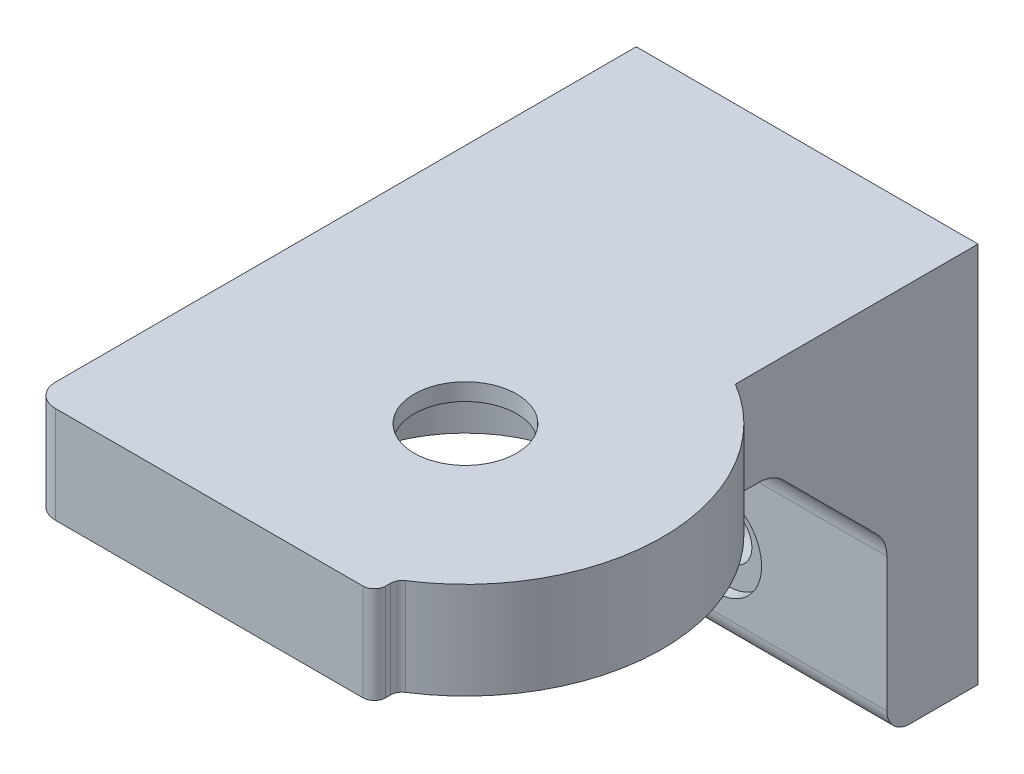
ISO-10303-21;
HEADER;
FILE_DESCRIPTION(('STEP AP214'),'2;1');
FILE_NAME('part.step','',(''),(''),'','','');
FILE_SCHEMA(('AUTOMOTIVE_DESIGN { 1 0 10303 214 1 1 1 1 }'));
ENDSEC;
DATA;
#1=APPLICATION_CONTEXT('core data for automotive mechanical design processes');
#2=APPLICATION_PROTOCOL_DEFINITION('international standard','automotive_design',2000,#1);
#3=PRODUCT_CONTEXT('',#1,'mechanical');
#4=PRODUCT('Part','Part','',(#3));
#5=PRODUCT_RELATED_PRODUCT_CATEGORY('part','',(#4));
#6=PRODUCT_DEFINITION_FORMATION('','',#4);
#7=PRODUCT_DEFINITION_CONTEXT('part definition',#1,'design');
#8=PRODUCT_DEFINITION('design','',#6,#7);
#9=PRODUCT_DEFINITION_SHAPE('','',#8);
#10=(LENGTH_UNIT() NAMED_UNIT(*) SI_UNIT(.MILLI.,.METRE.));
#11=(NAMED_UNIT(*) PLANE_ANGLE_UNIT() SI_UNIT($,.RADIAN.));
#12=(NAMED_UNIT(*) SI_UNIT($,.STERADIAN.) SOLID_ANGLE_UNIT());
#13=UNCERTAINTY_MEASURE_WITH_UNIT(LENGTH_MEASURE(1.E-05),#10,'distance_accuracy_value','');
#14=(GEOMETRIC_REPRESENTATION_CONTEXT(3) GLOBAL_UNCERTAINTY_ASSIGNED_CONTEXT((#13)) GLOBAL_UNIT_ASSIGNED_CONTEXT((#10,
#11,#12)) REPRESENTATION_CONTEXT('',''));
#15=CARTESIAN_POINT('',(0.,0.,0.));
#16=DIRECTION('',(0.,0.,1.));
#17=DIRECTION('',(1.,0.,0.));
#18=AXIS2_PLACEMENT_3D('',#15,#16,#17);
#19=CARTESIAN_POINT('',(4.69999956412333,-651.000000000001,1.34850202283498E-13));
#20=DIRECTION('',(0.,0.,1.));
#21=DIRECTION('',(-1.,0.,0.));
#22=AXIS2_PLACEMENT_3D('',#19,#20,#21);
#23=CYLINDRICAL_SURFACE('',#22,2.15);
#24=CARTESIAN_POINT('',(4.69999956412333,-651.000000000001,1.34850202283498E-13));
#25=DIRECTION('',(0.,0.,-1.));
#26=DIRECTION('',(-1.,0.,0.));
#27=AXIS2_PLACEMENT_3D('',#24,#25,#26);
#28=CIRCLE('',#27,2.15);
#29=CARTESIAN_POINT('',(2.54999956412332,-651.000000000001,1.354131691474E-13));
#30=VERTEX_POINT('',#29);
#31=EDGE_CURVE('E167',#30,#30,#28,.T.);
#32=ORIENTED_EDGE('',*,*,#31,.T.);
#33=EDGE_LOOP('',(#32));
#34=FACE_BOUND('',#33,.T.);
#35=CARTESIAN_POINT('',(4.69999956412555,-651.000000000001,6.99999999999998));
#36=DIRECTION('',(0.,0.,-1.));
#37=DIRECTION('',(-1.,0.,0.));
#38=AXIS2_PLACEMENT_3D('',#35,#36,#37);
#39=CIRCLE('',#38,2.15);
#40=CARTESIAN_POINT('',(2.54999956412555,-651.000000000001,6.99999999999998));
#41=VERTEX_POINT('',#40);
#42=EDGE_CURVE('E511',#41,#41,#39,.T.);
#43=ORIENTED_EDGE('',*,*,#42,.F.);
#44=EDGE_LOOP('',(#43));
#45=FACE_BOUND('',#44,.T.);
#46=ADVANCED_FACE('F35',(#34,#45),#23,.F.);
#47=CARTESIAN_POINT('',(-20.6000008716219,-626.500000000001,0.));
#48=DIRECTION('',(0.,1.,0.));
#49=DIRECTION('',(1.,0.,0.));
#50=AXIS2_PLACEMENT_3D('',#47,#48,#49);
#51=PLANE('',#50);
#52=CARTESIAN_POINT('',(10.8499995641886,-626.500000000001,36.149999999999));
#53=DIRECTION('',(0.,-1.,0.));
#54=DIRECTION('',(1.,0.,0.));
#55=AXIS2_PLACEMENT_3D('',#52,#53,#54);
#56=CIRCLE('',#55,4.5);
#57=CARTESIAN_POINT('',(15.3499995641886,-626.500000000001,36.149999999999));
#58=VERTEX_POINT('',#57);
#59=EDGE_CURVE('E161',#58,#58,#56,.T.);
#60=ORIENTED_EDGE('',*,*,#59,.F.);
#61=EDGE_LOOP('',(#60));
#62=FACE_BOUND('',#61,.T.);
#63=CARTESIAN_POINT('',(10.8499995641903,-626.500000000001,36.1500000000001));
#64=DIRECTION('',(0.,-1.,0.));
#65=DIRECTION('',(1.,0.,0.));
#66=AXIS2_PLACEMENT_3D('',#63,#64,#65);
#67=CIRCLE('',#66,11.);
#68=CARTESIAN_POINT('',(21.8499995641903,-626.500000000001,36.1500000000001));
#69=VERTEX_POINT('',#68);
#70=EDGE_CURVE('E215',#69,#69,#67,.T.);
#71=ORIENTED_EDGE('',*,*,#70,.T.);
#72=EDGE_LOOP('',(#71));
#73=FACE_BOUND('',#72,.T.);
#74=ADVANCED_FACE('F336',(#62,#73),#51,.F.);
#75=CARTESIAN_POINT('',(10.8499995641898,-626.500000000001,36.149999999999));
#76=DIRECTION('',(0.,1.,0.));
#77=DIRECTION('',(1.,0.,0.));
#78=AXIS2_PLACEMENT_3D('',#75,#76,#77);
#79=CYLINDRICAL_SURFACE('',#78,17.2871339440318);
#80=CARTESIAN_POINT('',(10.8499995641898,-633.500000000001,36.149999999999));
#81=DIRECTION('',(0.,-1.,0.));
#82=DIRECTION('',(1.,0.,0.));
#83=AXIS2_PLACEMENT_3D('',#80,#81,#82);
#84=CIRCLE('',#83,17.2871339440318);
#85=CARTESIAN_POINT('',(19.6999995641258,-633.500000000001,21.2999999999979));
#86=VERTEX_POINT('',#85);
#87=CARTESIAN_POINT('',(20.1613695070549,-633.500000000001,50.715142971697));
#88=VERTEX_POINT('',#87);
#89=EDGE_CURVE('E179',#86,#88,#84,.T.);
#90=ORIENTED_EDGE('',*,*,#89,.F.);
#91=DIRECTION('',(0.,1.,0.));
#92=VECTOR('',#91,1.);
#93=CARTESIAN_POINT('',(19.6999995641257,-626.500000000001,21.2999999999979));
#94=LINE('',#93,#92);
#95=CARTESIAN_POINT('',(19.6999995641257,-625.000000000001,21.2999999999979));
#96=VERTEX_POINT('',#95);
#97=EDGE_CURVE('E212',#86,#96,#94,.T.);
#98=ORIENTED_EDGE('',*,*,#97,.T.);
#99=CARTESIAN_POINT('',(10.8499995641898,-625.000000000001,36.149999999999));
#100=DIRECTION('',(0.,-1.,0.));
#101=DIRECTION('',(1.,0.,0.));
#102=AXIS2_PLACEMENT_3D('',#99,#100,#101);
#103=CIRCLE('',#102,17.2871339440318);
#104=CARTESIAN_POINT('',(20.1613695070548,-625.000000000001,50.715142971697));
#105=VERTEX_POINT('',#104);
#106=EDGE_CURVE('E193',#105,#96,#103,.F.);
#107=ORIENTED_EDGE('',*,*,#106,.F.);
#108=DIRECTION('',(0.,1.,0.));
#109=VECTOR('',#108,1.);
#110=CARTESIAN_POINT('',(20.1613695070548,-626.500000000001,50.715142971697));
#111=LINE('',#110,#109);
#112=EDGE_CURVE('E225',#88,#105,#111,.T.);
#113=ORIENTED_EDGE('',*,*,#112,.F.);
#114=EDGE_LOOP('',(#90,#98,#107,#113));
#115=FACE_BOUND('',#114,.T.);
#116=ADVANCED_FACE('F312',(#115),#79,.T.);
#117=CARTESIAN_POINT('',(19.6999995641257,-626.500000000001,0.));
#118=DIRECTION('',(1.,0.,0.));
#119=DIRECTION('',(0.,-1.,0.));
#120=AXIS2_PLACEMENT_3D('',#117,#118,#119);
#121=PLANE('',#120);
#122=DIRECTION('',(0.,0.,-1.));
#123=VECTOR('',#122,1.);
#124=CARTESIAN_POINT('',(19.6999995641258,-658.500000000001,8.00000000000058));
#125=LINE('',#124,#123);
#126=CARTESIAN_POINT('',(19.6999995641258,-658.500000000001,6.00000000000058));
#127=VERTEX_POINT('',#126);
#128=CARTESIAN_POINT('',(19.6999995641259,-658.500000000001,5.79383245849191E-13));
#129=VERTEX_POINT('',#128);
#130=EDGE_CURVE('E148',#127,#129,#125,.T.);
#131=ORIENTED_EDGE('',*,*,#130,.T.);
#132=DIRECTION('',(0.,1.,0.));
#133=VECTOR('',#132,1.);
#134=CARTESIAN_POINT('',(19.6999995641257,-626.500000000001,5.75011736338895E-13));
#135=LINE('',#134,#133);
#136=CARTESIAN_POINT('',(19.6999995641257,-625.000000000001,5.75011736338895E-13));
#137=VERTEX_POINT('',#136);
#138=EDGE_CURVE('E160',#129,#137,#135,.T.);
#139=ORIENTED_EDGE('',*,*,#138,.T.);
#140=DIRECTION('',(0.,0.,1.));
#141=VECTOR('',#140,1.);
#142=CARTESIAN_POINT('',(19.6999995641257,-625.000000000001,0.));
#143=LINE('',#142,#141);
#144=EDGE_CURVE('E208',#137,#96,#143,.T.);
#145=ORIENTED_EDGE('',*,*,#144,.T.);
#146=ORIENTED_EDGE('',*,*,#97,.F.);
#147=DIRECTION('',(0.,0.,1.));
#148=VECTOR('',#147,1.);
#149=CARTESIAN_POINT('',(19.6999995641257,-633.500000000001,0.));
#150=LINE('',#149,#148);
#151=CARTESIAN_POINT('',(19.6999995641258,-633.500000000001,19.2426406871199));
#152=VERTEX_POINT('',#151);
#153=EDGE_CURVE('E191',#152,#86,#150,.T.);
#154=ORIENTED_EDGE('',*,*,#153,.F.);
#155=CARTESIAN_POINT('',(19.6999995641258,-636.500000000001,19.2426406871199));
#156=DIRECTION('',(-1.,0.,0.));
#157=DIRECTION('',(0.,-1.,0.));
#158=AXIS2_PLACEMENT_3D('',#155,#156,#157);
#159=CIRCLE('',#158,3.);
#160=CARTESIAN_POINT('',(19.6999995641258,-634.378679656441,17.1213203435603));
#161=VERTEX_POINT('',#160);
#162=EDGE_CURVE('E272',#161,#152,#159,.F.);
#163=ORIENTED_EDGE('',*,*,#162,.F.);
#164=DIRECTION('',(0.,0.707106781186545,0.70710678118655));
#165=VECTOR('',#164,1.);
#166=CARTESIAN_POINT('',(19.6999995641258,-633.500000000001,18.0000000000006));
#167=LINE('',#166,#165);
#168=CARTESIAN_POINT('',(19.6999995641258,-642.621320343561,8.87867965644103));
#169=VERTEX_POINT('',#168);
#170=EDGE_CURVE('E222',#169,#161,#167,.T.);
#171=ORIENTED_EDGE('',*,*,#170,.F.);
#172=CARTESIAN_POINT('',(19.6999995641258,-644.74264068712,11.0000000000006));
#173=DIRECTION('',(-1.,0.,0.));
#174=DIRECTION('',(0.,-1.,0.));
#175=AXIS2_PLACEMENT_3D('',#172,#173,#174);
#176=CIRCLE('',#175,3.);
#177=CARTESIAN_POINT('',(19.6999995641257,-644.74264068712,8.00000000000058));
#178=VERTEX_POINT('',#177);
#179=EDGE_CURVE('E263',#178,#169,#176,.F.);
#180=ORIENTED_EDGE('',*,*,#179,.F.);
#181=DIRECTION('',(0.,1.,0.));
#182=VECTOR('',#181,1.);
#183=CARTESIAN_POINT('',(19.6999995641256,-633.500000000001,8.00000000000058));
#184=LINE('',#183,#182);
#185=CARTESIAN_POINT('',(19.6999995641258,-656.500000000001,8.00000000000058));
#186=VERTEX_POINT('',#185);
#187=EDGE_CURVE('E166',#186,#178,#184,.T.);
#188=ORIENTED_EDGE('',*,*,#187,.F.);
#189=CARTESIAN_POINT('',(19.6999995641258,-656.500000000001,6.00000000000058));
#190=DIRECTION('',(-1.,0.,0.));
#191=DIRECTION('',(0.,-1.,0.));
#192=AXIS2_PLACEMENT_3D('',#189,#190,#191);
#193=CIRCLE('',#192,2.);
#194=EDGE_CURVE('E276',#127,#186,#193,.T.);
#195=ORIENTED_EDGE('',*,*,#194,.F.);
#196=EDGE_LOOP('',(#131,#139,#145,#146,#154,#163,#171,#180,#188,#195));
#197=FACE_BOUND('',#196,.T.);
#198=ADVANCED_FACE('F281',(#197),#121,.T.);
#199=CARTESIAN_POINT('',(-20.6000008716219,-626.500000000001,0.));
#200=DIRECTION('',(0.,0.,1.));
#201=DIRECTION('',(-1.,0.,0.));
#202=AXIS2_PLACEMENT_3D('',#199,#200,#201);
#203=PLANE('',#202);
#204=ORIENTED_EDGE('',*,*,#31,.F.);
#205=EDGE_LOOP('',(#204));
#206=FACE_BOUND('',#205,.T.);
#207=DIRECTION('',(-1.,0.,0.));
#208=VECTOR('',#207,1.);
#209=CARTESIAN_POINT('',(-20.6000008716219,-625.000000000001,0.));
#210=LINE('',#209,#208);
#211=CARTESIAN_POINT('',(-10.3000004358096,-625.000000000001,1.38777878078145E-13));
#212=VERTEX_POINT('',#211);
#213=EDGE_CURVE('E206',#137,#212,#210,.T.);
#214=ORIENTED_EDGE('',*,*,#213,.F.);
#215=ORIENTED_EDGE('',*,*,#138,.F.);
#216=DIRECTION('',(1.,0.,0.));
#217=VECTOR('',#216,1.);
#218=CARTESIAN_POINT('',(19.6999995641259,-658.500000000001,5.79383245849191E-13));
#219=LINE('',#218,#217);
#220=CARTESIAN_POINT('',(-10.3000004358094,-658.500000000001,1.50088281492348E-13));
#221=VERTEX_POINT('',#220);
#222=EDGE_CURVE('E144',#221,#129,#219,.T.);
#223=ORIENTED_EDGE('',*,*,#222,.F.);
#224=DIRECTION('',(0.,1.,0.));
#225=VECTOR('',#224,1.);
#226=CARTESIAN_POINT('',(-10.3000004358096,-626.500000000001,1.38777878078145E-13));
#227=LINE('',#226,#225);
#228=EDGE_CURVE('E152',#221,#212,#227,.T.);
#229=ORIENTED_EDGE('',*,*,#228,.T.);
#230=EDGE_LOOP('',(#214,#215,#223,#229));
#231=FACE_BOUND('',#230,.T.);
#232=ADVANCED_FACE('F163',(#206,#231),#203,.F.);
#233=CARTESIAN_POINT('',(-10.3000004358096,-626.500000000001,0.));
#234=DIRECTION('',(1.,0.,0.));
#235=DIRECTION('',(0.,-1.,0.));
#236=AXIS2_PLACEMENT_3D('',#233,#234,#235);
#237=PLANE('',#236);
#238=DIRECTION('',(0.,-1.,0.));
#239=VECTOR('',#238,1.);
#240=CARTESIAN_POINT('',(-10.3000004358097,-633.500000000001,8.00000000000015));
#241=LINE('',#240,#239);
#242=CARTESIAN_POINT('',(-10.3000004358096,-644.74264068712,8.00000000000015));
#243=VERTEX_POINT('',#242);
#244=CARTESIAN_POINT('',(-10.3000004358096,-656.500000000001,8.00000000000015));
#245=VERTEX_POINT('',#244);
#246=EDGE_CURVE('E149',#243,#245,#241,.T.);
#247=ORIENTED_EDGE('',*,*,#246,.F.);
#248=CARTESIAN_POINT('',(-10.3000004358096,-644.74264068712,11.0000000000002));
#249=DIRECTION('',(-1.,0.,0.));
#250=DIRECTION('',(0.,-1.,0.));
#251=AXIS2_PLACEMENT_3D('',#248,#249,#250);
#252=CIRCLE('',#251,3.);
#253=CARTESIAN_POINT('',(-10.3000004358096,-642.621320343561,8.8786796564406));
#254=VERTEX_POINT('',#253);
#255=EDGE_CURVE('E266',#254,#243,#252,.T.);
#256=ORIENTED_EDGE('',*,*,#255,.F.);
#257=DIRECTION('',(0.,-0.707106781186545,-0.70710678118655));
#258=VECTOR('',#257,1.);
#259=CARTESIAN_POINT('',(-10.3000004358096,-639.000000000001,12.5000000000001));
#260=LINE('',#259,#258);
#261=CARTESIAN_POINT('',(-10.3000004358096,-634.378679656441,17.1213203435599));
#262=VERTEX_POINT('',#261);
#263=EDGE_CURVE('E219',#262,#254,#260,.T.);
#264=ORIENTED_EDGE('',*,*,#263,.F.);
#265=CARTESIAN_POINT('',(-10.3000004358096,-636.500000000001,19.2426406871195));
#266=DIRECTION('',(-1.,0.,0.));
#267=DIRECTION('',(0.,-1.,0.));
#268=AXIS2_PLACEMENT_3D('',#265,#266,#267);
#269=CIRCLE('',#268,3.);
#270=CARTESIAN_POINT('',(-10.3000004358096,-633.500000000001,19.2426406871195));
#271=VERTEX_POINT('',#270);
#272=EDGE_CURVE('E269',#271,#262,#269,.T.);
#273=ORIENTED_EDGE('',*,*,#272,.F.);
#274=DIRECTION('',(0.,0.,1.));
#275=VECTOR('',#274,1.);
#276=CARTESIAN_POINT('',(-10.3000004358096,-633.500000000001,0.));
#277=LINE('',#276,#275);
#278=CARTESIAN_POINT('',(-10.3000004358096,-633.500000000001,51.));
#279=VERTEX_POINT('',#278);
#280=EDGE_CURVE('E188',#271,#279,#277,.T.);
#281=ORIENTED_EDGE('',*,*,#280,.T.);
#282=DIRECTION('',(0.,1.,0.));
#283=VECTOR('',#282,1.);
#284=CARTESIAN_POINT('',(-10.3000004358096,-626.500000000001,51.));
#285=LINE('',#284,#283);
#286=CARTESIAN_POINT('',(-10.3000004358096,-625.000000000001,51.));
#287=VERTEX_POINT('',#286);
#288=EDGE_CURVE('E250',#287,#279,#285,.F.);
#289=ORIENTED_EDGE('',*,*,#288,.F.);
#290=DIRECTION('',(0.,0.,1.));
#291=VECTOR('',#290,1.);
#292=CARTESIAN_POINT('',(-10.3000004358096,-625.000000000001,0.));
#293=LINE('',#292,#291);
#294=EDGE_CURVE('E157',#212,#287,#293,.T.);
#295=ORIENTED_EDGE('',*,*,#294,.F.);
#296=ORIENTED_EDGE('',*,*,#228,.F.);
#297=DIRECTION('',(0.,0.,-1.));
#298=VECTOR('',#297,1.);
#299=CARTESIAN_POINT('',(-10.3000004358095,-658.500000000001,8.00000000000015));
#300=LINE('',#299,#298);
#301=CARTESIAN_POINT('',(-10.3000004358095,-658.500000000001,6.00000000000015));
#302=VERTEX_POINT('',#301);
#303=EDGE_CURVE('E139',#302,#221,#300,.T.);
#304=ORIENTED_EDGE('',*,*,#303,.F.);
#305=CARTESIAN_POINT('',(-10.3000004358095,-656.500000000001,6.00000000000015));
#306=DIRECTION('',(-1.,0.,0.));
#307=DIRECTION('',(0.,-1.,0.));
#308=AXIS2_PLACEMENT_3D('',#305,#306,#307);
#309=CIRCLE('',#308,2.);
#310=EDGE_CURVE('E11',#245,#302,#309,.F.);
#311=ORIENTED_EDGE('',*,*,#310,.F.);
#312=EDGE_LOOP('',(#247,#256,#264,#273,#281,#289,#295,#296,#304,#311));
#313=FACE_BOUND('',#312,.T.);
#314=ADVANCED_FACE('F154',(#313),#237,.F.);
#315=CARTESIAN_POINT('',(-20.600000871622,-626.500000000001,53.));
#316=DIRECTION('',(0.,0.,-1.));
#317=DIRECTION('',(1.,0.,0.));
#318=AXIS2_PLACEMENT_3D('',#315,#316,#317);
#319=PLANE('',#318);
#320=DIRECTION('',(1.,0.,0.));
#321=VECTOR('',#320,1.);
#322=CARTESIAN_POINT('',(-20.6000008716219,-633.500000000001,53.));
#323=LINE('',#322,#321);
#324=CARTESIAN_POINT('',(-8.30000043580961,-633.500000000001,53.));
#325=VERTEX_POINT('',#324);
#326=CARTESIAN_POINT('',(18.6999995641257,-633.500000000001,53.));
#327=VERTEX_POINT('',#326);
#328=EDGE_CURVE('E185',#325,#327,#323,.T.);
#329=ORIENTED_EDGE('',*,*,#328,.T.);
#330=DIRECTION('',(0.,1.,0.));
#331=VECTOR('',#330,1.);
#332=CARTESIAN_POINT('',(18.6999995641257,-626.500000000001,53.));
#333=LINE('',#332,#331);
#334=CARTESIAN_POINT('',(18.6999995641257,-625.000000000001,53.));
#335=VERTEX_POINT('',#334);
#336=EDGE_CURVE('E236',#335,#327,#333,.F.);
#337=ORIENTED_EDGE('',*,*,#336,.F.);
#338=DIRECTION('',(1.,0.,0.));
#339=VECTOR('',#338,1.);
#340=CARTESIAN_POINT('',(-20.600000871622,-625.000000000001,53.));
#341=LINE('',#340,#339);
#342=CARTESIAN_POINT('',(-8.30000043580964,-625.000000000001,53.));
#343=VERTEX_POINT('',#342);
#344=EDGE_CURVE('E202',#343,#335,#341,.T.);
#345=ORIENTED_EDGE('',*,*,#344,.F.);
#346=DIRECTION('',(0.,1.,0.));
#347=VECTOR('',#346,1.);
#348=CARTESIAN_POINT('',(-8.30000043580963,-626.500000000001,53.));
#349=LINE('',#348,#347);
#350=EDGE_CURVE('E245',#325,#343,#349,.T.);
#351=ORIENTED_EDGE('',*,*,#350,.F.);
#352=EDGE_LOOP('',(#329,#337,#345,#351));
#353=FACE_BOUND('',#352,.T.);
#354=ADVANCED_FACE('F325',(#353),#319,.F.);
#355=CARTESIAN_POINT('',(19.6999995641257,-626.500000000001,0.));
#356=DIRECTION('',(-1.,0.,0.));
#357=DIRECTION('',(0.,1.,0.));
#358=AXIS2_PLACEMENT_3D('',#355,#356,#357);
#359=PLANE('',#358);
#360=DIRECTION('',(0.,0.,-1.));
#361=VECTOR('',#360,1.);
#362=CARTESIAN_POINT('',(19.6999995641257,-625.000000000001,0.));
#363=LINE('',#362,#361);
#364=CARTESIAN_POINT('',(19.6999995641257,-625.000000000001,52.));
#365=VERTEX_POINT('',#364);
#366=CARTESIAN_POINT('',(19.6999995641257,-625.000000000001,51.5576853514144));
#367=VERTEX_POINT('',#366);
#368=EDGE_CURVE('E199',#365,#367,#363,.T.);
#369=ORIENTED_EDGE('',*,*,#368,.F.);
#370=DIRECTION('',(0.,1.,0.));
#371=VECTOR('',#370,1.);
#372=CARTESIAN_POINT('',(19.6999995641257,-626.500000000001,52.));
#373=LINE('',#372,#371);
#374=CARTESIAN_POINT('',(19.6999995641257,-633.500000000001,52.));
#375=VERTEX_POINT('',#374);
#376=EDGE_CURVE('E228',#375,#365,#373,.T.);
#377=ORIENTED_EDGE('',*,*,#376,.F.);
#378=DIRECTION('',(0.,0.,-1.));
#379=VECTOR('',#378,1.);
#380=CARTESIAN_POINT('',(19.6999995641257,-633.500000000001,0.));
#381=LINE('',#380,#379);
#382=CARTESIAN_POINT('',(19.6999995641257,-633.500000000001,51.5576853514144));
#383=VERTEX_POINT('',#382);
#384=EDGE_CURVE('E182',#375,#383,#381,.T.);
#385=ORIENTED_EDGE('',*,*,#384,.T.);
#386=DIRECTION('',(0.,-1.,0.));
#387=VECTOR('',#386,1.);
#388=CARTESIAN_POINT('',(19.6999995641257,-633.500000000001,51.5576853514144));
#389=LINE('',#388,#387);
#390=EDGE_CURVE('E231',#367,#383,#389,.T.);
#391=ORIENTED_EDGE('',*,*,#390,.F.);
#392=EDGE_LOOP('',(#369,#377,#385,#391));
#393=FACE_BOUND('',#392,.T.);
#394=ADVANCED_FACE('F320',(#393),#359,.F.);
#395=CARTESIAN_POINT('',(10.8499995641886,-626.500000000001,36.149999999999));
#396=DIRECTION('',(0.,1.,0.));
#397=DIRECTION('',(1.,0.,0.));
#398=AXIS2_PLACEMENT_3D('',#395,#396,#397);
#399=CYLINDRICAL_SURFACE('',#398,4.5);
#400=ORIENTED_EDGE('',*,*,#59,.T.);
#401=EDGE_LOOP('',(#400));
#402=FACE_BOUND('',#401,.T.);
#403=CARTESIAN_POINT('',(10.8499995641886,-625.000000000001,36.149999999999));
#404=DIRECTION('',(0.,-1.,0.));
#405=DIRECTION('',(1.,0.,0.));
#406=AXIS2_PLACEMENT_3D('',#403,#404,#405);
#407=CIRCLE('',#406,4.5);
#408=CARTESIAN_POINT('',(15.3499995641886,-625.000000000001,36.149999999999));
#409=VERTEX_POINT('',#408);
#410=EDGE_CURVE('E196',#409,#409,#407,.T.);
#411=ORIENTED_EDGE('',*,*,#410,.F.);
#412=EDGE_LOOP('',(#411));
#413=FACE_BOUND('',#412,.T.);
#414=ADVANCED_FACE('F332',(#402,#413),#399,.F.);
#415=CARTESIAN_POINT('',(-20.6000008716219,-625.000000000001,0.));
#416=DIRECTION('',(0.,1.,0.));
#417=DIRECTION('',(1.,0.,0.));
#418=AXIS2_PLACEMENT_3D('',#415,#416,#417);
#419=PLANE('',#418);
#420=ORIENTED_EDGE('',*,*,#344,.T.);
#421=CARTESIAN_POINT('',(18.6999995641257,-625.000000000001,52.));
#422=DIRECTION('',(0.,-1.,0.));
#423=DIRECTION('',(1.,0.,0.));
#424=AXIS2_PLACEMENT_3D('',#421,#422,#423);
#425=CIRCLE('',#424,1.);
#426=EDGE_CURVE('E234',#365,#335,#425,.T.);
#427=ORIENTED_EDGE('',*,*,#426,.F.);
#428=ORIENTED_EDGE('',*,*,#368,.T.);
#429=CARTESIAN_POINT('',(20.6999995641257,-625.000000000001,51.5576853514144));
#430=DIRECTION('',(0.,-1.,0.));
#431=DIRECTION('',(1.,0.,0.));
#432=AXIS2_PLACEMENT_3D('',#429,#430,#431);
#433=CIRCLE('',#432,1.);
#434=EDGE_CURVE('E241',#105,#367,#433,.F.);
#435=ORIENTED_EDGE('',*,*,#434,.F.);
#436=ORIENTED_EDGE('',*,*,#106,.T.);
#437=ORIENTED_EDGE('',*,*,#144,.F.);
#438=ORIENTED_EDGE('',*,*,#213,.T.);
#439=ORIENTED_EDGE('',*,*,#294,.T.);
#440=CARTESIAN_POINT('',(-8.30000043580963,-625.000000000001,51.));
#441=DIRECTION('',(0.,-1.,0.));
#442=DIRECTION('',(1.,0.,0.));
#443=AXIS2_PLACEMENT_3D('',#440,#441,#442);
#444=CIRCLE('',#443,2.);
#445=EDGE_CURVE('E248',#343,#287,#444,.T.);
#446=ORIENTED_EDGE('',*,*,#445,.F.);
#447=EDGE_LOOP('',(#420,#427,#428,#435,#436,#437,#438,#439,#446));
#448=FACE_BOUND('',#447,.T.);
#449=ORIENTED_EDGE('',*,*,#410,.T.);
#450=EDGE_LOOP('',(#449));
#451=FACE_BOUND('',#450,.T.);
#452=ADVANCED_FACE('F304',(#448,#451),#419,.T.);
#453=CARTESIAN_POINT('',(10.8499995641898,-633.500000000001,36.149999999999));
#454=DIRECTION('',(0.,1.,0.));
#455=DIRECTION('',(1.,0.,0.));
#456=AXIS2_PLACEMENT_3D('',#453,#454,#455);
#457=PLANE('',#456);
#458=CARTESIAN_POINT('',(10.8499995641903,-633.500000000001,36.1500000000001));
#459=DIRECTION('',(0.,-1.,0.));
#460=DIRECTION('',(1.,0.,0.));
#461=AXIS2_PLACEMENT_3D('',#458,#459,#460);
#462=CIRCLE('',#461,11.);
#463=CARTESIAN_POINT('',(21.8499995641903,-633.500000000001,36.1500000000001));
#464=VERTEX_POINT('',#463);
#465=EDGE_CURVE('E175',#464,#464,#462,.T.);
#466=ORIENTED_EDGE('',*,*,#465,.F.);
#467=EDGE_LOOP('',(#466));
#468=FACE_BOUND('',#467,.T.);
#469=ORIENTED_EDGE('',*,*,#153,.T.);
#470=ORIENTED_EDGE('',*,*,#89,.T.);
#471=CARTESIAN_POINT('',(20.6999995641257,-633.500000000001,51.5576853514144));
#472=DIRECTION('',(0.,-1.,0.));
#473=DIRECTION('',(1.,0.,0.));
#474=AXIS2_PLACEMENT_3D('',#471,#472,#473);
#475=CIRCLE('',#474,1.);
#476=EDGE_CURVE('E243',#383,#88,#475,.T.);
#477=ORIENTED_EDGE('',*,*,#476,.F.);
#478=ORIENTED_EDGE('',*,*,#384,.F.);
#479=CARTESIAN_POINT('',(18.6999995641257,-633.500000000001,52.));
#480=DIRECTION('',(0.,-1.,0.));
#481=DIRECTION('',(1.,0.,0.));
#482=AXIS2_PLACEMENT_3D('',#479,#480,#481);
#483=CIRCLE('',#482,1.);
#484=EDGE_CURVE('E239',#327,#375,#483,.F.);
#485=ORIENTED_EDGE('',*,*,#484,.F.);
#486=ORIENTED_EDGE('',*,*,#328,.F.);
#487=CARTESIAN_POINT('',(-8.30000043580961,-633.500000000001,51.));
#488=DIRECTION('',(0.,-1.,0.));
#489=DIRECTION('',(1.,0.,0.));
#490=AXIS2_PLACEMENT_3D('',#487,#488,#489);
#491=CIRCLE('',#490,2.);
#492=EDGE_CURVE('E253',#279,#325,#491,.F.);
#493=ORIENTED_EDGE('',*,*,#492,.F.);
#494=ORIENTED_EDGE('',*,*,#280,.F.);
#495=DIRECTION('',(-1.,0.,0.));
#496=VECTOR('',#495,1.);
#497=CARTESIAN_POINT('',(-10.3000004358096,-633.500000000001,19.2426406871195));
#498=LINE('',#497,#496);
#499=EDGE_CURVE('E261',#152,#271,#498,.T.);
#500=ORIENTED_EDGE('',*,*,#499,.F.);
#501=EDGE_LOOP('',(#469,#470,#477,#478,#485,#486,#493,#494,#500));
#502=FACE_BOUND('',#501,.T.);
#503=ADVANCED_FACE('F297',(#468,#502),#457,.F.);
#504=CARTESIAN_POINT('',(10.8499995641903,-633.500000000001,36.1500000000001));
#505=DIRECTION('',(0.,1.,0.));
#506=DIRECTION('',(1.,0.,0.));
#507=AXIS2_PLACEMENT_3D('',#504,#505,#506);
#508=CYLINDRICAL_SURFACE('',#507,11.);
#509=ORIENTED_EDGE('',*,*,#465,.T.);
#510=EDGE_LOOP('',(#509));
#511=FACE_BOUND('',#510,.T.);
#512=ORIENTED_EDGE('',*,*,#70,.F.);
#513=EDGE_LOOP('',(#512));
#514=FACE_BOUND('',#513,.T.);
#515=ADVANCED_FACE('F354',(#511,#514),#508,.F.);
#516=CARTESIAN_POINT('',(19.6999995641258,-658.500000000001,8.00000000000058));
#517=DIRECTION('',(0.,-1.,0.));
#518=DIRECTION('',(0.,0.,-1.));
#519=AXIS2_PLACEMENT_3D('',#516,#517,#518);
#520=PLANE('',#519);
#521=ORIENTED_EDGE('',*,*,#303,.T.);
#522=ORIENTED_EDGE('',*,*,#222,.T.);
#523=ORIENTED_EDGE('',*,*,#130,.F.);
#524=DIRECTION('',(1.,0.,0.));
#525=VECTOR('',#524,1.);
#526=CARTESIAN_POINT('',(19.6999995641258,-658.500000000001,6.00000000000058));
#527=LINE('',#526,#525);
#528=EDGE_CURVE('E146',#302,#127,#527,.T.);
#529=ORIENTED_EDGE('',*,*,#528,.F.);
#530=EDGE_LOOP('',(#521,#522,#523,#529));
#531=FACE_BOUND('',#530,.T.);
#532=ADVANCED_FACE('F141',(#531),#520,.T.);
#533=CARTESIAN_POINT('',(-20.6000008716238,0.,8.));
#534=DIRECTION('',(0.,0.,1.));
#535=DIRECTION('',(-1.,0.,0.));
#536=AXIS2_PLACEMENT_3D('',#533,#534,#535);
#537=PLANE('',#536);
#538=CARTESIAN_POINT('',(4.69999956412555,-651.000000000001,7.99999999999998));
#539=DIRECTION('',(0.,0.,-1.));
#540=DIRECTION('',(-1.,0.,0.));
#541=AXIS2_PLACEMENT_3D('',#538,#539,#540);
#542=CIRCLE('',#541,4.);
#543=CARTESIAN_POINT('',(0.699999564125552,-651.000000000001,7.99999999999998));
#544=VERTEX_POINT('',#543);
#545=EDGE_CURVE('E515',#544,#544,#542,.T.);
#546=ORIENTED_EDGE('',*,*,#545,.T.);
#547=EDGE_LOOP('',(#546));
#548=FACE_BOUND('',#547,.T.);
#549=ORIENTED_EDGE('',*,*,#187,.T.);
#550=DIRECTION('',(1.,0.,0.));
#551=VECTOR('',#550,1.);
#552=CARTESIAN_POINT('',(-20.600000871622,-644.74264068712,8.));
#553=LINE('',#552,#551);
#554=EDGE_CURVE('E255',#243,#178,#553,.T.);
#555=ORIENTED_EDGE('',*,*,#554,.F.);
#556=ORIENTED_EDGE('',*,*,#246,.T.);
#557=DIRECTION('',(1.,0.,0.));
#558=VECTOR('',#557,1.);
#559=CARTESIAN_POINT('',(-20.6000008716192,-656.500000000001,8.));
#560=LINE('',#559,#558);
#561=EDGE_CURVE('E43',#186,#245,#560,.F.);
#562=ORIENTED_EDGE('',*,*,#561,.F.);
#563=EDGE_LOOP('',(#549,#555,#556,#562));
#564=FACE_BOUND('',#563,.T.);
#565=ADVANCED_FACE('F283',(#548,#564),#537,.T.);
#566=CARTESIAN_POINT('',(10.8499995641901,-633.500000000001,18.0000000000005));
#567=DIRECTION('',(0.,0.70710678118655,-0.707106781186545));
#568=DIRECTION('',(-1.,0.,0.));
#569=AXIS2_PLACEMENT_3D('',#566,#567,#568);
#570=PLANE('',#569);
#571=ORIENTED_EDGE('',*,*,#170,.T.);
#572=DIRECTION('',(-1.,0.,0.));
#573=VECTOR('',#572,1.);
#574=CARTESIAN_POINT('',(19.6999995641258,-634.378679656441,17.1213203435603));
#575=LINE('',#574,#573);
#576=EDGE_CURVE('E257',#262,#161,#575,.F.);
#577=ORIENTED_EDGE('',*,*,#576,.F.);
#578=ORIENTED_EDGE('',*,*,#263,.T.);
#579=DIRECTION('',(1.,0.,0.));
#580=VECTOR('',#579,1.);
#581=CARTESIAN_POINT('',(10.8499995641903,-642.621320343561,8.87867965644089));
#582=LINE('',#581,#580);
#583=EDGE_CURVE('E259',#169,#254,#582,.F.);
#584=ORIENTED_EDGE('',*,*,#583,.F.);
#585=EDGE_LOOP('',(#571,#577,#578,#584));
#586=FACE_BOUND('',#585,.T.);
#587=ADVANCED_FACE('F290',(#586),#570,.F.);
#588=CARTESIAN_POINT('',(20.6999995641257,-626.500000000001,51.5576853514144));
#589=DIRECTION('',(0.,1.,0.));
#590=DIRECTION('',(1.,0.,0.));
#591=AXIS2_PLACEMENT_3D('',#588,#589,#590);
#592=CYLINDRICAL_SURFACE('',#591,1.);
#593=ORIENTED_EDGE('',*,*,#476,.T.);
#594=ORIENTED_EDGE('',*,*,#112,.T.);
#595=ORIENTED_EDGE('',*,*,#434,.T.);
#596=ORIENTED_EDGE('',*,*,#390,.T.);
#597=EDGE_LOOP('',(#593,#594,#595,#596));
#598=FACE_BOUND('',#597,.T.);
#599=ADVANCED_FACE('F317',(#598),#592,.F.);
#600=CARTESIAN_POINT('',(18.6999995641257,-626.500000000001,52.));
#601=DIRECTION('',(0.,1.,0.));
#602=DIRECTION('',(1.,0.,0.));
#603=AXIS2_PLACEMENT_3D('',#600,#601,#602);
#604=CYLINDRICAL_SURFACE('',#603,1.);
#605=ORIENTED_EDGE('',*,*,#484,.T.);
#606=ORIENTED_EDGE('',*,*,#376,.T.);
#607=ORIENTED_EDGE('',*,*,#426,.T.);
#608=ORIENTED_EDGE('',*,*,#336,.T.);
#609=EDGE_LOOP('',(#605,#606,#607,#608));
#610=FACE_BOUND('',#609,.T.);
#611=ADVANCED_FACE('F322',(#610),#604,.T.);
#612=CARTESIAN_POINT('',(-8.30000043580963,-626.500000000001,51.));
#613=DIRECTION('',(0.,1.,0.));
#614=DIRECTION('',(1.,0.,0.));
#615=AXIS2_PLACEMENT_3D('',#612,#613,#614);
#616=CYLINDRICAL_SURFACE('',#615,2.);
#617=ORIENTED_EDGE('',*,*,#492,.T.);
#618=ORIENTED_EDGE('',*,*,#350,.T.);
#619=ORIENTED_EDGE('',*,*,#445,.T.);
#620=ORIENTED_EDGE('',*,*,#288,.T.);
#621=EDGE_LOOP('',(#617,#618,#619,#620));
#622=FACE_BOUND('',#621,.T.);
#623=ADVANCED_FACE('F300',(#622),#616,.T.);
#624=CARTESIAN_POINT('',(-20.600000871622,-644.74264068712,11.));
#625=DIRECTION('',(1.,0.,0.));
#626=DIRECTION('',(0.,0.,1.));
#627=AXIS2_PLACEMENT_3D('',#624,#625,#626);
#628=CYLINDRICAL_SURFACE('',#627,3.);
#629=ORIENTED_EDGE('',*,*,#255,.T.);
#630=ORIENTED_EDGE('',*,*,#554,.T.);
#631=ORIENTED_EDGE('',*,*,#179,.T.);
#632=ORIENTED_EDGE('',*,*,#583,.T.);
#633=EDGE_LOOP('',(#629,#630,#631,#632));
#634=FACE_BOUND('',#633,.T.);
#635=ADVANCED_FACE('F286',(#634),#628,.F.);
#636=CARTESIAN_POINT('',(10.8499995641901,-636.500000000001,19.2426406871198));
#637=DIRECTION('',(1.,0.,0.));
#638=DIRECTION('',(0.,0.,1.));
#639=AXIS2_PLACEMENT_3D('',#636,#637,#638);
#640=CYLINDRICAL_SURFACE('',#639,3.);
#641=ORIENTED_EDGE('',*,*,#162,.T.);
#642=ORIENTED_EDGE('',*,*,#499,.T.);
#643=ORIENTED_EDGE('',*,*,#272,.T.);
#644=ORIENTED_EDGE('',*,*,#576,.T.);
#645=EDGE_LOOP('',(#641,#642,#643,#644));
#646=FACE_BOUND('',#645,.T.);
#647=ADVANCED_FACE('F293',(#646),#640,.F.);
#648=CARTESIAN_POINT('',(19.6999995641258,-656.500000000001,6.00000000000058));
#649=DIRECTION('',(1.,0.,0.));
#650=DIRECTION('',(0.,0.,1.));
#651=AXIS2_PLACEMENT_3D('',#648,#649,#650);
#652=CYLINDRICAL_SURFACE('',#651,2.);
#653=ORIENTED_EDGE('',*,*,#310,.T.);
#654=ORIENTED_EDGE('',*,*,#528,.T.);
#655=ORIENTED_EDGE('',*,*,#194,.T.);
#656=ORIENTED_EDGE('',*,*,#561,.T.);
#657=EDGE_LOOP('',(#653,#654,#655,#656));
#658=FACE_BOUND('',#657,.T.);
#659=ADVANCED_FACE('F37',(#658),#652,.T.);
#660=CARTESIAN_POINT('',(4.69999956412555,-651.000000000001,6.99999999999998));
#661=DIRECTION('',(0.,0.,1.));
#662=DIRECTION('',(-1.,0.,0.));
#663=AXIS2_PLACEMENT_3D('',#660,#661,#662);
#664=CYLINDRICAL_SURFACE('',#663,4.);
#665=CARTESIAN_POINT('',(4.69999956412555,-651.000000000001,6.99999999999998));
#666=DIRECTION('',(0.,0.,-1.));
#667=DIRECTION('',(-1.,0.,0.));
#668=AXIS2_PLACEMENT_3D('',#665,#666,#667);
#669=CIRCLE('',#668,4.);
#670=CARTESIAN_POINT('',(0.699999564125552,-651.000000000001,6.99999999999998));
#671=VERTEX_POINT('',#670);
#672=EDGE_CURVE('E171',#671,#671,#669,.T.);
#673=ORIENTED_EDGE('',*,*,#672,.T.);
#674=EDGE_LOOP('',(#673));
#675=FACE_BOUND('',#674,.T.);
#676=ORIENTED_EDGE('',*,*,#545,.F.);
#677=EDGE_LOOP('',(#676));
#678=FACE_BOUND('',#677,.T.);
#679=ADVANCED_FACE('F347',(#675,#678),#664,.F.);
#680=CARTESIAN_POINT('',(-20.6000008716239,0.,7.00000000000001));
#681=DIRECTION('',(0.,0.,1.));
#682=DIRECTION('',(-1.,0.,0.));
#683=AXIS2_PLACEMENT_3D('',#680,#681,#682);
#684=PLANE('',#683);
#685=ORIENTED_EDGE('',*,*,#42,.T.);
#686=EDGE_LOOP('',(#685));
#687=FACE_BOUND('',#686,.T.);
#688=ORIENTED_EDGE('',*,*,#672,.F.);
#689=EDGE_LOOP('',(#688));
#690=FACE_BOUND('',#689,.T.);
#691=ADVANCED_FACE('F493',(#687,#690),#684,.T.);
#692=CLOSED_SHELL('',(#46,#74,#116,#198,#232,#314,#354,#394,#414,#452,#503,#515,#532,#565,#587,
#599,#611,#623,#635,#647,#659,#679,#691));
#693=MANIFOLD_SOLID_BREP('B2',#692);
#694=ADVANCED_BREP_SHAPE_REPRESENTATION('',(#18,#693),#14);
#695=SHAPE_DEFINITION_REPRESENTATION(#9,#694);
ENDSEC;
END-ISO-10303-21;
